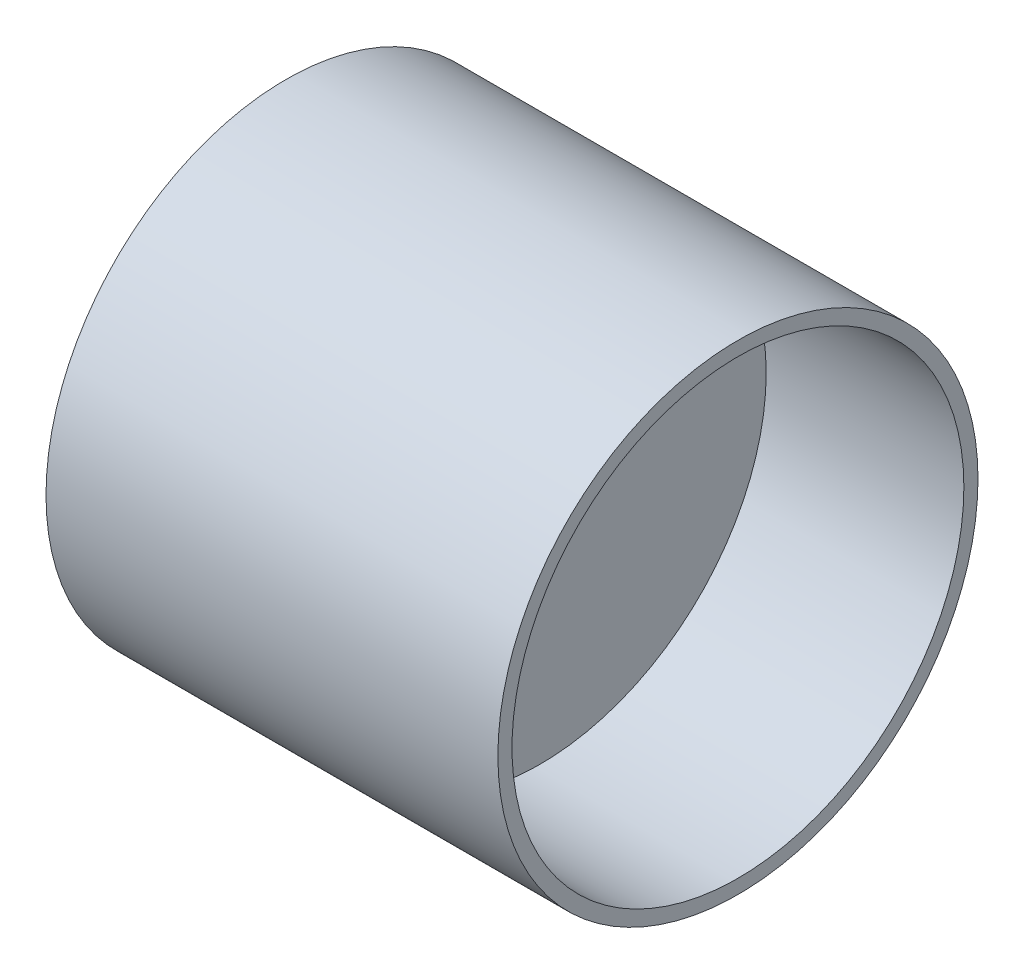
ISO-10303-21;
HEADER;
FILE_DESCRIPTION(('STEP AP214'),'2;1');
FILE_NAME('part.step','',(''),(''),'','','');
FILE_SCHEMA(('AUTOMOTIVE_DESIGN { 1 0 10303 214 1 1 1 1 }'));
ENDSEC;
DATA;
#1=APPLICATION_CONTEXT('core data for automotive mechanical design processes');
#2=APPLICATION_PROTOCOL_DEFINITION('international standard','automotive_design',2000,#1);
#3=PRODUCT_CONTEXT('',#1,'mechanical');
#4=PRODUCT('Part','Part','',(#3));
#5=PRODUCT_RELATED_PRODUCT_CATEGORY('part','',(#4));
#6=PRODUCT_DEFINITION_FORMATION('','',#4);
#7=PRODUCT_DEFINITION_CONTEXT('part definition',#1,'design');
#8=PRODUCT_DEFINITION('design','',#6,#7);
#9=PRODUCT_DEFINITION_SHAPE('','',#8);
#10=(LENGTH_UNIT() NAMED_UNIT(*) SI_UNIT(.MILLI.,.METRE.));
#11=(NAMED_UNIT(*) PLANE_ANGLE_UNIT() SI_UNIT($,.RADIAN.));
#12=(NAMED_UNIT(*) SI_UNIT($,.STERADIAN.) SOLID_ANGLE_UNIT());
#13=UNCERTAINTY_MEASURE_WITH_UNIT(LENGTH_MEASURE(1.E-05),#10,'distance_accuracy_value','');
#14=(GEOMETRIC_REPRESENTATION_CONTEXT(3) GLOBAL_UNCERTAINTY_ASSIGNED_CONTEXT((#13)) GLOBAL_UNIT_ASSIGNED_CONTEXT((#10,
#11,#12)) REPRESENTATION_CONTEXT('',''));
#15=CARTESIAN_POINT('',(0.,0.,0.));
#16=DIRECTION('',(0.,0.,1.));
#17=DIRECTION('',(1.,0.,0.));
#18=AXIS2_PLACEMENT_3D('',#15,#16,#17);
#19=CARTESIAN_POINT('',(50.,0.,0.));
#20=DIRECTION('',(-1.,0.,0.));
#21=DIRECTION('',(0.,0.,1.));
#22=AXIS2_PLACEMENT_3D('',#19,#20,#21);
#23=CYLINDRICAL_SURFACE('',#22,42.5);
#24=CARTESIAN_POINT('',(50.,0.,0.));
#25=DIRECTION('',(1.,0.,0.));
#26=DIRECTION('',(0.,0.,-1.));
#27=AXIS2_PLACEMENT_3D('',#24,#25,#26);
#28=CIRCLE('',#27,42.5);
#29=CARTESIAN_POINT('',(50.,0.,-42.5));
#30=VERTEX_POINT('',#29);
#31=EDGE_CURVE('E10',#30,#30,#28,.T.);
#32=ORIENTED_EDGE('',*,*,#31,.F.);
#33=EDGE_LOOP('',(#32));
#34=FACE_BOUND('',#33,.T.);
#35=CARTESIAN_POINT('',(-30.,0.,0.));
#36=DIRECTION('',(-1.,0.,0.));
#37=DIRECTION('',(0.,0.,1.));
#38=AXIS2_PLACEMENT_3D('',#35,#36,#37);
#39=CIRCLE('',#38,42.5);
#40=CARTESIAN_POINT('',(-30.,0.,42.5));
#41=VERTEX_POINT('',#40);
#42=EDGE_CURVE('E49',#41,#41,#39,.T.);
#43=ORIENTED_EDGE('',*,*,#42,.F.);
#44=EDGE_LOOP('',(#43));
#45=FACE_BOUND('',#44,.T.);
#46=ADVANCED_FACE('F34',(#34,#45),#23,.T.);
#47=CARTESIAN_POINT('',(50.,0.,0.));
#48=DIRECTION('',(1.,0.,0.));
#49=DIRECTION('',(0.,0.,-1.));
#50=AXIS2_PLACEMENT_3D('',#47,#48,#49);
#51=PLANE('',#50);
#52=CARTESIAN_POINT('',(50.,0.,0.));
#53=DIRECTION('',(1.,0.,0.));
#54=DIRECTION('',(0.,0.,-1.));
#55=AXIS2_PLACEMENT_3D('',#52,#53,#54);
#56=CIRCLE('',#55,40.);
#57=CARTESIAN_POINT('',(50.,0.,-40.));
#58=VERTEX_POINT('',#57);
#59=EDGE_CURVE('E44',#58,#58,#56,.T.);
#60=ORIENTED_EDGE('',*,*,#59,.F.);
#61=EDGE_LOOP('',(#60));
#62=FACE_BOUND('',#61,.T.);
#63=ORIENTED_EDGE('',*,*,#31,.T.);
#64=EDGE_LOOP('',(#63));
#65=FACE_BOUND('',#64,.T.);
#66=ADVANCED_FACE('F57',(#62,#65),#51,.T.);
#67=CARTESIAN_POINT('',(15.,0.,0.));
#68=DIRECTION('',(1.,0.,0.));
#69=DIRECTION('',(0.,0.,-1.));
#70=AXIS2_PLACEMENT_3D('',#67,#68,#69);
#71=CYLINDRICAL_SURFACE('',#70,40.);
#72=CARTESIAN_POINT('',(15.,0.,0.));
#73=DIRECTION('',(1.,0.,0.));
#74=DIRECTION('',(0.,0.,-1.));
#75=AXIS2_PLACEMENT_3D('',#72,#73,#74);
#76=CIRCLE('',#75,40.);
#77=CARTESIAN_POINT('',(15.,0.,-40.));
#78=VERTEX_POINT('',#77);
#79=EDGE_CURVE('E40',#78,#78,#76,.T.);
#80=ORIENTED_EDGE('',*,*,#79,.F.);
#81=EDGE_LOOP('',(#80));
#82=FACE_BOUND('',#81,.T.);
#83=ORIENTED_EDGE('',*,*,#59,.T.);
#84=EDGE_LOOP('',(#83));
#85=FACE_BOUND('',#84,.T.);
#86=ADVANCED_FACE('F62',(#82,#85),#71,.F.);
#87=CARTESIAN_POINT('',(15.,0.,0.));
#88=DIRECTION('',(1.,0.,0.));
#89=DIRECTION('',(0.,0.,-1.));
#90=AXIS2_PLACEMENT_3D('',#87,#88,#89);
#91=PLANE('',#90);
#92=ORIENTED_EDGE('',*,*,#79,.T.);
#93=EDGE_LOOP('',(#92));
#94=FACE_BOUND('',#93,.T.);
#95=ADVANCED_FACE('F67',(#94),#91,.T.);
#96=CARTESIAN_POINT('',(-30.,0.,0.));
#97=DIRECTION('',(-1.,0.,0.));
#98=DIRECTION('',(0.,0.,1.));
#99=AXIS2_PLACEMENT_3D('',#96,#97,#98);
#100=PLANE('',#99);
#101=ORIENTED_EDGE('',*,*,#42,.T.);
#102=EDGE_LOOP('',(#101));
#103=FACE_BOUND('',#102,.T.);
#104=ADVANCED_FACE('F54',(#103),#100,.T.);
#105=CLOSED_SHELL('',(#46,#66,#86,#95,#104));
#106=MANIFOLD_SOLID_BREP('B2',#105);
#107=ADVANCED_BREP_SHAPE_REPRESENTATION('',(#18,#106),#14);
#108=SHAPE_DEFINITION_REPRESENTATION(#9,#107);
ENDSEC;
END-ISO-10303-21;
